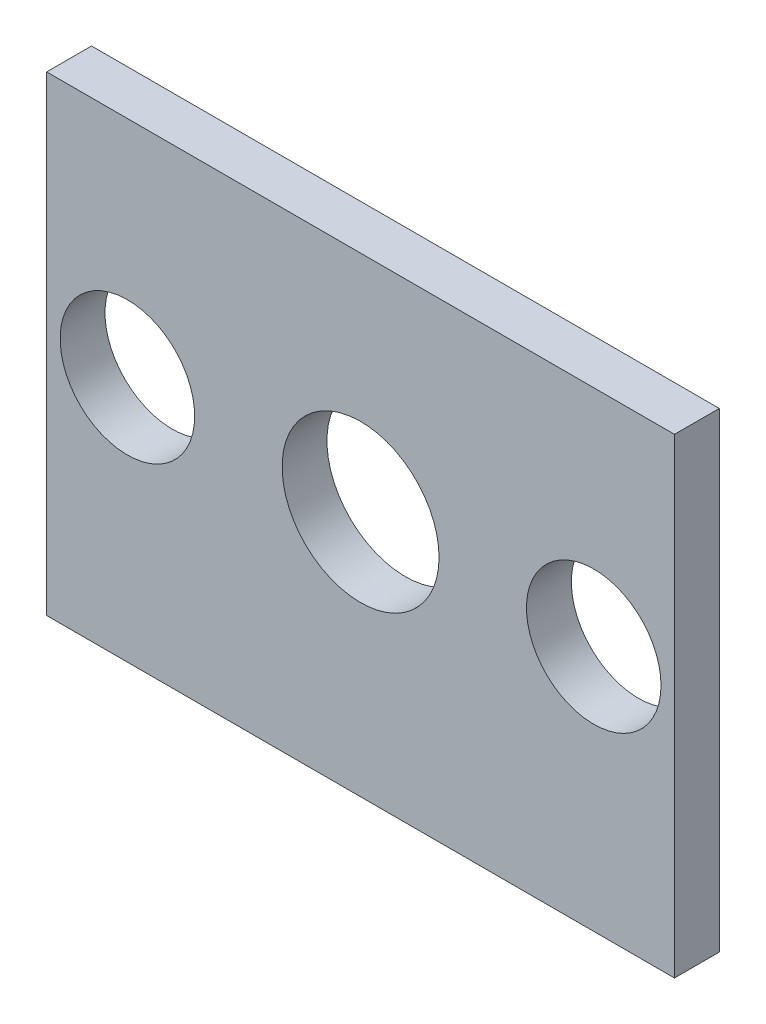
ISO-10303-21;
HEADER;
FILE_DESCRIPTION(('STEP AP214'),'2;1');
FILE_NAME('part.step','',(''),(''),'','','');
FILE_SCHEMA(('AUTOMOTIVE_DESIGN { 1 0 10303 214 1 1 1 1 }'));
ENDSEC;
DATA;
#1=APPLICATION_CONTEXT('core data for automotive mechanical design processes');
#2=APPLICATION_PROTOCOL_DEFINITION('international standard','automotive_design',2000,#1);
#3=PRODUCT_CONTEXT('',#1,'mechanical');
#4=PRODUCT('Part','Part','',(#3));
#5=PRODUCT_RELATED_PRODUCT_CATEGORY('part','',(#4));
#6=PRODUCT_DEFINITION_FORMATION('','',#4);
#7=PRODUCT_DEFINITION_CONTEXT('part definition',#1,'design');
#8=PRODUCT_DEFINITION('design','',#6,#7);
#9=PRODUCT_DEFINITION_SHAPE('','',#8);
#10=(LENGTH_UNIT() NAMED_UNIT(*) SI_UNIT(.MILLI.,.METRE.));
#11=(NAMED_UNIT(*) PLANE_ANGLE_UNIT() SI_UNIT($,.RADIAN.));
#12=(NAMED_UNIT(*) SI_UNIT($,.STERADIAN.) SOLID_ANGLE_UNIT());
#13=UNCERTAINTY_MEASURE_WITH_UNIT(LENGTH_MEASURE(1.E-05),#10,'distance_accuracy_value','');
#14=(GEOMETRIC_REPRESENTATION_CONTEXT(3) GLOBAL_UNCERTAINTY_ASSIGNED_CONTEXT((#13)) GLOBAL_UNIT_ASSIGNED_CONTEXT((#10,
#11,#12)) REPRESENTATION_CONTEXT('',''));
#15=CARTESIAN_POINT('',(0.,0.,0.));
#16=DIRECTION('',(0.,0.,1.));
#17=DIRECTION('',(1.,0.,0.));
#18=AXIS2_PLACEMENT_3D('',#15,#16,#17);
#19=CARTESIAN_POINT('',(0.,0.,6.35));
#20=DIRECTION('',(0.,0.,1.));
#21=DIRECTION('',(1.,0.,0.));
#22=AXIS2_PLACEMENT_3D('',#19,#20,#21);
#23=PLANE('',#22);
#24=CARTESIAN_POINT('',(0.,0.,6.35));
#25=DIRECTION('',(0.,0.,1.));
#26=DIRECTION('',(1.,0.,0.));
#27=AXIS2_PLACEMENT_3D('',#24,#25,#26);
#28=CIRCLE('',#27,11.1125);
#29=CARTESIAN_POINT('',(11.1125,0.,6.35));
#30=VERTEX_POINT('',#29);
#31=EDGE_CURVE('E115',#30,#30,#28,.T.);
#32=ORIENTED_EDGE('',*,*,#31,.F.);
#33=EDGE_LOOP('',(#32));
#34=FACE_BOUND('',#33,.T.);
#35=DIRECTION('',(0.,-1.,0.));
#36=VECTOR('',#35,1.);
#37=CARTESIAN_POINT('',(-44.45,31.75,6.35));
#38=LINE('',#37,#36);
#39=CARTESIAN_POINT('',(-44.45,31.75,6.35));
#40=VERTEX_POINT('',#39);
#41=CARTESIAN_POINT('',(-44.45,-34.925,6.35));
#42=VERTEX_POINT('',#41);
#43=EDGE_CURVE('E85',#40,#42,#38,.T.);
#44=ORIENTED_EDGE('',*,*,#43,.T.);
#45=DIRECTION('',(1.,0.,0.));
#46=VECTOR('',#45,1.);
#47=CARTESIAN_POINT('',(-44.45,-34.925,6.35));
#48=LINE('',#47,#46);
#49=CARTESIAN_POINT('',(44.45,-34.925,6.35));
#50=VERTEX_POINT('',#49);
#51=EDGE_CURVE('E80',#42,#50,#48,.T.);
#52=ORIENTED_EDGE('',*,*,#51,.T.);
#53=DIRECTION('',(0.,1.,0.));
#54=VECTOR('',#53,1.);
#55=CARTESIAN_POINT('',(44.45,31.75,6.35));
#56=LINE('',#55,#54);
#57=CARTESIAN_POINT('',(44.45,31.75,6.35));
#58=VERTEX_POINT('',#57);
#59=EDGE_CURVE('E83',#50,#58,#56,.T.);
#60=ORIENTED_EDGE('',*,*,#59,.T.);
#61=DIRECTION('',(-1.,0.,0.));
#62=VECTOR('',#61,1.);
#63=CARTESIAN_POINT('',(-44.45,31.75,6.35));
#64=LINE('',#63,#62);
#65=EDGE_CURVE('E50',#58,#40,#64,.T.);
#66=ORIENTED_EDGE('',*,*,#65,.T.);
#67=EDGE_LOOP('',(#44,#52,#60,#66));
#68=FACE_BOUND('',#67,.T.);
#69=CARTESIAN_POINT('',(-33.02,0.,6.35));
#70=DIRECTION('',(0.,0.,1.));
#71=DIRECTION('',(1.,0.,0.));
#72=AXIS2_PLACEMENT_3D('',#69,#70,#71);
#73=CIRCLE('',#72,9.525);
#74=CARTESIAN_POINT('',(-23.495,0.,6.35));
#75=VERTEX_POINT('',#74);
#76=EDGE_CURVE('E100',#75,#75,#73,.T.);
#77=ORIENTED_EDGE('',*,*,#76,.F.);
#78=EDGE_LOOP('',(#77));
#79=FACE_BOUND('',#78,.T.);
#80=CARTESIAN_POINT('',(33.02,0.,6.35));
#81=DIRECTION('',(0.,0.,1.));
#82=DIRECTION('',(1.,0.,0.));
#83=AXIS2_PLACEMENT_3D('',#80,#81,#82);
#84=CIRCLE('',#83,9.525);
#85=CARTESIAN_POINT('',(42.545,0.,6.35));
#86=VERTEX_POINT('',#85);
#87=EDGE_CURVE('E121',#86,#86,#84,.T.);
#88=ORIENTED_EDGE('',*,*,#87,.F.);
#89=EDGE_LOOP('',(#88));
#90=FACE_BOUND('',#89,.T.);
#91=ADVANCED_FACE('F33',(#34,#68,#79,#90),#23,.T.);
#92=CARTESIAN_POINT('',(0.,0.,0.));
#93=DIRECTION('',(0.,0.,1.));
#94=DIRECTION('',(1.,0.,0.));
#95=AXIS2_PLACEMENT_3D('',#92,#93,#94);
#96=PLANE('',#95);
#97=DIRECTION('',(0.,-1.,0.));
#98=VECTOR('',#97,1.);
#99=CARTESIAN_POINT('',(-44.45,31.75,0.));
#100=LINE('',#99,#98);
#101=CARTESIAN_POINT('',(-44.45,31.75,0.));
#102=VERTEX_POINT('',#101);
#103=CARTESIAN_POINT('',(-44.45,-34.925,0.));
#104=VERTEX_POINT('',#103);
#105=EDGE_CURVE('E97',#102,#104,#100,.T.);
#106=ORIENTED_EDGE('',*,*,#105,.F.);
#107=DIRECTION('',(-1.,0.,0.));
#108=VECTOR('',#107,1.);
#109=CARTESIAN_POINT('',(-44.45,31.75,0.));
#110=LINE('',#109,#108);
#111=CARTESIAN_POINT('',(44.45,31.75,0.));
#112=VERTEX_POINT('',#111);
#113=EDGE_CURVE('E73',#112,#102,#110,.T.);
#114=ORIENTED_EDGE('',*,*,#113,.F.);
#115=DIRECTION('',(0.,1.,0.));
#116=VECTOR('',#115,1.);
#117=CARTESIAN_POINT('',(44.45,31.75,0.));
#118=LINE('',#117,#116);
#119=CARTESIAN_POINT('',(44.45,-34.925,0.));
#120=VERTEX_POINT('',#119);
#121=EDGE_CURVE('E67',#120,#112,#118,.T.);
#122=ORIENTED_EDGE('',*,*,#121,.F.);
#123=DIRECTION('',(1.,0.,0.));
#124=VECTOR('',#123,1.);
#125=CARTESIAN_POINT('',(-44.45,-34.925,0.));
#126=LINE('',#125,#124);
#127=EDGE_CURVE('E89',#104,#120,#126,.T.);
#128=ORIENTED_EDGE('',*,*,#127,.F.);
#129=EDGE_LOOP('',(#106,#114,#122,#128));
#130=FACE_BOUND('',#129,.T.);
#131=CARTESIAN_POINT('',(-33.02,0.,0.));
#132=DIRECTION('',(0.,0.,1.));
#133=DIRECTION('',(1.,0.,0.));
#134=AXIS2_PLACEMENT_3D('',#131,#132,#133);
#135=CIRCLE('',#134,9.525);
#136=CARTESIAN_POINT('',(-23.495,0.,0.));
#137=VERTEX_POINT('',#136);
#138=EDGE_CURVE('E112',#137,#137,#135,.T.);
#139=ORIENTED_EDGE('',*,*,#138,.T.);
#140=EDGE_LOOP('',(#139));
#141=FACE_BOUND('',#140,.T.);
#142=CARTESIAN_POINT('',(0.,0.,0.));
#143=DIRECTION('',(0.,0.,1.));
#144=DIRECTION('',(1.,0.,0.));
#145=AXIS2_PLACEMENT_3D('',#142,#143,#144);
#146=CIRCLE('',#145,11.1125);
#147=CARTESIAN_POINT('',(11.1125,0.,0.));
#148=VERTEX_POINT('',#147);
#149=EDGE_CURVE('E118',#148,#148,#146,.T.);
#150=ORIENTED_EDGE('',*,*,#149,.T.);
#151=EDGE_LOOP('',(#150));
#152=FACE_BOUND('',#151,.T.);
#153=CARTESIAN_POINT('',(33.02,0.,0.));
#154=DIRECTION('',(0.,0.,1.));
#155=DIRECTION('',(1.,0.,0.));
#156=AXIS2_PLACEMENT_3D('',#153,#154,#155);
#157=CIRCLE('',#156,9.525);
#158=CARTESIAN_POINT('',(42.545,0.,0.));
#159=VERTEX_POINT('',#158);
#160=EDGE_CURVE('E124',#159,#159,#157,.T.);
#161=ORIENTED_EDGE('',*,*,#160,.T.);
#162=EDGE_LOOP('',(#161));
#163=FACE_BOUND('',#162,.T.);
#164=ADVANCED_FACE('F108',(#130,#141,#152,#163),#96,.F.);
#165=CARTESIAN_POINT('',(-44.45,31.75,6.35));
#166=DIRECTION('',(1.,0.,0.));
#167=DIRECTION('',(0.,1.,0.));
#168=AXIS2_PLACEMENT_3D('',#165,#166,#167);
#169=PLANE('',#168);
#170=ORIENTED_EDGE('',*,*,#105,.T.);
#171=DIRECTION('',(0.,0.,-1.));
#172=VECTOR('',#171,1.);
#173=CARTESIAN_POINT('',(-44.45,-34.925,6.35));
#174=LINE('',#173,#172);
#175=EDGE_CURVE('E11',#42,#104,#174,.T.);
#176=ORIENTED_EDGE('',*,*,#175,.F.);
#177=ORIENTED_EDGE('',*,*,#43,.F.);
#178=DIRECTION('',(0.,0.,-1.));
#179=VECTOR('',#178,1.);
#180=CARTESIAN_POINT('',(-44.45,31.75,6.35));
#181=LINE('',#180,#179);
#182=EDGE_CURVE('E93',#40,#102,#181,.T.);
#183=ORIENTED_EDGE('',*,*,#182,.T.);
#184=EDGE_LOOP('',(#170,#176,#177,#183));
#185=FACE_BOUND('',#184,.T.);
#186=ADVANCED_FACE('F35',(#185),#169,.F.);
#187=CARTESIAN_POINT('',(-44.45,-34.925,6.35));
#188=DIRECTION('',(0.,1.,0.));
#189=DIRECTION('',(0.,0.,1.));
#190=AXIS2_PLACEMENT_3D('',#187,#188,#189);
#191=PLANE('',#190);
#192=ORIENTED_EDGE('',*,*,#127,.T.);
#193=DIRECTION('',(0.,0.,-1.));
#194=VECTOR('',#193,1.);
#195=CARTESIAN_POINT('',(44.45,-34.925,6.35));
#196=LINE('',#195,#194);
#197=EDGE_CURVE('E42',#50,#120,#196,.T.);
#198=ORIENTED_EDGE('',*,*,#197,.F.);
#199=ORIENTED_EDGE('',*,*,#51,.F.);
#200=ORIENTED_EDGE('',*,*,#175,.T.);
#201=EDGE_LOOP('',(#192,#198,#199,#200));
#202=FACE_BOUND('',#201,.T.);
#203=ADVANCED_FACE('F88',(#202),#191,.F.);
#204=CARTESIAN_POINT('',(44.45,31.75,6.35));
#205=DIRECTION('',(-1.,0.,0.));
#206=DIRECTION('',(0.,-1.,0.));
#207=AXIS2_PLACEMENT_3D('',#204,#205,#206);
#208=PLANE('',#207);
#209=ORIENTED_EDGE('',*,*,#121,.T.);
#210=DIRECTION('',(0.,0.,-1.));
#211=VECTOR('',#210,1.);
#212=CARTESIAN_POINT('',(44.45,31.75,6.35));
#213=LINE('',#212,#211);
#214=EDGE_CURVE('E90',#58,#112,#213,.T.);
#215=ORIENTED_EDGE('',*,*,#214,.F.);
#216=ORIENTED_EDGE('',*,*,#59,.F.);
#217=ORIENTED_EDGE('',*,*,#197,.T.);
#218=EDGE_LOOP('',(#209,#215,#216,#217));
#219=FACE_BOUND('',#218,.T.);
#220=ADVANCED_FACE('F91',(#219),#208,.F.);
#221=CARTESIAN_POINT('',(-44.45,31.75,6.35));
#222=DIRECTION('',(0.,-1.,0.));
#223=DIRECTION('',(0.,0.,-1.));
#224=AXIS2_PLACEMENT_3D('',#221,#222,#223);
#225=PLANE('',#224);
#226=ORIENTED_EDGE('',*,*,#113,.T.);
#227=ORIENTED_EDGE('',*,*,#182,.F.);
#228=ORIENTED_EDGE('',*,*,#65,.F.);
#229=ORIENTED_EDGE('',*,*,#214,.T.);
#230=EDGE_LOOP('',(#226,#227,#228,#229));
#231=FACE_BOUND('',#230,.T.);
#232=ADVANCED_FACE('F105',(#231),#225,.F.);
#233=CARTESIAN_POINT('',(-33.02,0.,6.35));
#234=DIRECTION('',(0.,0.,-1.));
#235=DIRECTION('',(-1.,0.,0.));
#236=AXIS2_PLACEMENT_3D('',#233,#234,#235);
#237=CYLINDRICAL_SURFACE('',#236,9.525);
#238=ORIENTED_EDGE('',*,*,#76,.T.);
#239=EDGE_LOOP('',(#238));
#240=FACE_BOUND('',#239,.T.);
#241=ORIENTED_EDGE('',*,*,#138,.F.);
#242=EDGE_LOOP('',(#241));
#243=FACE_BOUND('',#242,.T.);
#244=ADVANCED_FACE('F142',(#240,#243),#237,.F.);
#245=CARTESIAN_POINT('',(0.,0.,6.35));
#246=DIRECTION('',(0.,0.,-1.));
#247=DIRECTION('',(-1.,0.,0.));
#248=AXIS2_PLACEMENT_3D('',#245,#246,#247);
#249=CYLINDRICAL_SURFACE('',#248,11.1125);
#250=ORIENTED_EDGE('',*,*,#31,.T.);
#251=EDGE_LOOP('',(#250));
#252=FACE_BOUND('',#251,.T.);
#253=ORIENTED_EDGE('',*,*,#149,.F.);
#254=EDGE_LOOP('',(#253));
#255=FACE_BOUND('',#254,.T.);
#256=ADVANCED_FACE('F188',(#252,#255),#249,.F.);
#257=CARTESIAN_POINT('',(33.02,0.,6.35));
#258=DIRECTION('',(0.,0.,-1.));
#259=DIRECTION('',(-1.,0.,0.));
#260=AXIS2_PLACEMENT_3D('',#257,#258,#259);
#261=CYLINDRICAL_SURFACE('',#260,9.525);
#262=ORIENTED_EDGE('',*,*,#87,.T.);
#263=EDGE_LOOP('',(#262));
#264=FACE_BOUND('',#263,.T.);
#265=ORIENTED_EDGE('',*,*,#160,.F.);
#266=EDGE_LOOP('',(#265));
#267=FACE_BOUND('',#266,.T.);
#268=ADVANCED_FACE('F130',(#264,#267),#261,.F.);
#269=CLOSED_SHELL('',(#91,#164,#186,#203,#220,#232,#244,#256,#268));
#270=MANIFOLD_SOLID_BREP('B2',#269);
#271=ADVANCED_BREP_SHAPE_REPRESENTATION('',(#18,#270),#14);
#272=SHAPE_DEFINITION_REPRESENTATION(#9,#271);
ENDSEC;
END-ISO-10303-21;
